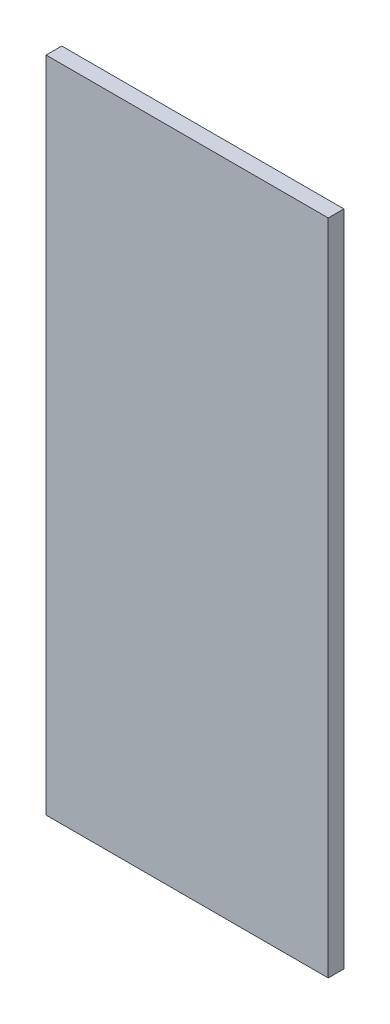
ISO-10303-21;
HEADER;
FILE_DESCRIPTION(('STEP AP214'),'2;1');
FILE_NAME('part.step','',(''),(''),'','','');
FILE_SCHEMA(('AUTOMOTIVE_DESIGN { 1 0 10303 214 1 1 1 1 }'));
ENDSEC;
DATA;
#1=APPLICATION_CONTEXT('core data for automotive mechanical design processes');
#2=APPLICATION_PROTOCOL_DEFINITION('international standard','automotive_design',2000,#1);
#3=PRODUCT_CONTEXT('',#1,'mechanical');
#4=PRODUCT('Part','Part','',(#3));
#5=PRODUCT_RELATED_PRODUCT_CATEGORY('part','',(#4));
#6=PRODUCT_DEFINITION_FORMATION('','',#4);
#7=PRODUCT_DEFINITION_CONTEXT('part definition',#1,'design');
#8=PRODUCT_DEFINITION('design','',#6,#7);
#9=PRODUCT_DEFINITION_SHAPE('','',#8);
#10=(LENGTH_UNIT() NAMED_UNIT(*) SI_UNIT(.MILLI.,.METRE.));
#11=(NAMED_UNIT(*) PLANE_ANGLE_UNIT() SI_UNIT($,.RADIAN.));
#12=(NAMED_UNIT(*) SI_UNIT($,.STERADIAN.) SOLID_ANGLE_UNIT());
#13=UNCERTAINTY_MEASURE_WITH_UNIT(LENGTH_MEASURE(1.E-05),#10,'distance_accuracy_value','');
#14=(GEOMETRIC_REPRESENTATION_CONTEXT(3) GLOBAL_UNCERTAINTY_ASSIGNED_CONTEXT((#13)) GLOBAL_UNIT_ASSIGNED_CONTEXT((#10,
#11,#12)) REPRESENTATION_CONTEXT('',''));
#15=CARTESIAN_POINT('',(0.,0.,0.));
#16=DIRECTION('',(0.,0.,1.));
#17=DIRECTION('',(1.,0.,0.));
#18=AXIS2_PLACEMENT_3D('',#15,#16,#17);
#19=CARTESIAN_POINT('',(224.613166788928,-127.373178207628,283.941063903925));
#20=DIRECTION('',(-1.,0.,0.));
#21=DIRECTION('',(0.,-1.,0.));
#22=AXIS2_PLACEMENT_3D('',#19,#20,#21);
#23=PLANE('',#22);
#24=DIRECTION('',(0.,1.,0.));
#25=VECTOR('',#24,1.);
#26=CARTESIAN_POINT('',(224.613166788928,-127.373178207628,283.432971220494));
#27=LINE('',#26,#25);
#28=CARTESIAN_POINT('',(224.613166788928,-127.373178207628,283.432971220494));
#29=VERTEX_POINT('',#28);
#30=CARTESIAN_POINT('',(224.613166788928,-106.020408950721,283.432971220494));
#31=VERTEX_POINT('',#30);
#32=EDGE_CURVE('E79',#29,#31,#27,.T.);
#33=ORIENTED_EDGE('',*,*,#32,.F.);
#34=DIRECTION('',(0.,0.,-1.));
#35=VECTOR('',#34,1.);
#36=CARTESIAN_POINT('',(224.613166788928,-127.373178207628,283.941063903925));
#37=LINE('',#36,#35);
#38=CARTESIAN_POINT('',(224.613166788928,-127.373178207628,283.941063903925));
#39=VERTEX_POINT('',#38);
#40=EDGE_CURVE('E32',#39,#29,#37,.T.);
#41=ORIENTED_EDGE('',*,*,#40,.F.);
#42=DIRECTION('',(0.,1.,0.));
#43=VECTOR('',#42,1.);
#44=CARTESIAN_POINT('',(224.613166788928,-127.373178207628,283.941063903925));
#45=LINE('',#44,#43);
#46=CARTESIAN_POINT('',(224.613166788928,-106.020408950721,283.941063903925));
#47=VERTEX_POINT('',#46);
#48=EDGE_CURVE('E71',#39,#47,#45,.T.);
#49=ORIENTED_EDGE('',*,*,#48,.T.);
#50=DIRECTION('',(0.,0.,-1.));
#51=VECTOR('',#50,1.);
#52=CARTESIAN_POINT('',(224.613166788928,-106.020408950721,283.941063903925));
#53=LINE('',#52,#51);
#54=EDGE_CURVE('E10',#47,#31,#53,.T.);
#55=ORIENTED_EDGE('',*,*,#54,.T.);
#56=EDGE_LOOP('',(#33,#41,#49,#55));
#57=FACE_BOUND('',#56,.T.);
#58=ADVANCED_FACE('F16',(#57),#23,.T.);
#59=CARTESIAN_POINT('',(224.613166788928,-106.020408950721,283.941063903925));
#60=DIRECTION('',(0.,1.,0.));
#61=DIRECTION('',(0.,0.,1.));
#62=AXIS2_PLACEMENT_3D('',#59,#60,#61);
#63=PLANE('',#62);
#64=DIRECTION('',(1.,0.,0.));
#65=VECTOR('',#64,1.);
#66=CARTESIAN_POINT('',(224.613166788928,-106.020408950721,283.432971220494));
#67=LINE('',#66,#65);
#68=CARTESIAN_POINT('',(233.765936045835,-106.020408950721,283.432971220494));
#69=VERTEX_POINT('',#68);
#70=EDGE_CURVE('E82',#31,#69,#67,.T.);
#71=ORIENTED_EDGE('',*,*,#70,.F.);
#72=ORIENTED_EDGE('',*,*,#54,.F.);
#73=DIRECTION('',(1.,0.,0.));
#74=VECTOR('',#73,1.);
#75=CARTESIAN_POINT('',(224.613166788928,-106.020408950721,283.941063903925));
#76=LINE('',#75,#74);
#77=CARTESIAN_POINT('',(233.765936045835,-106.020408950721,283.941063903925));
#78=VERTEX_POINT('',#77);
#79=EDGE_CURVE('E67',#47,#78,#76,.T.);
#80=ORIENTED_EDGE('',*,*,#79,.T.);
#81=DIRECTION('',(0.,0.,-1.));
#82=VECTOR('',#81,1.);
#83=CARTESIAN_POINT('',(233.765936045835,-106.020408950721,283.941063903925));
#84=LINE('',#83,#82);
#85=EDGE_CURVE('E24',#78,#69,#84,.T.);
#86=ORIENTED_EDGE('',*,*,#85,.T.);
#87=EDGE_LOOP('',(#71,#72,#80,#86));
#88=FACE_BOUND('',#87,.T.);
#89=ADVANCED_FACE('F68',(#88),#63,.T.);
#90=CARTESIAN_POINT('',(233.765936045835,-106.020408950721,283.941063903925));
#91=DIRECTION('',(1.,0.,0.));
#92=DIRECTION('',(0.,1.,0.));
#93=AXIS2_PLACEMENT_3D('',#90,#91,#92);
#94=PLANE('',#93);
#95=DIRECTION('',(0.,-1.,0.));
#96=VECTOR('',#95,1.);
#97=CARTESIAN_POINT('',(233.765936045835,-106.020408950721,283.432971220494));
#98=LINE('',#97,#96);
#99=CARTESIAN_POINT('',(233.765936045835,-127.373178207628,283.432971220494));
#100=VERTEX_POINT('',#99);
#101=EDGE_CURVE('E65',#69,#100,#98,.T.);
#102=ORIENTED_EDGE('',*,*,#101,.F.);
#103=ORIENTED_EDGE('',*,*,#85,.F.);
#104=DIRECTION('',(0.,-1.,0.));
#105=VECTOR('',#104,1.);
#106=CARTESIAN_POINT('',(233.765936045835,-106.020408950721,283.941063903925));
#107=LINE('',#106,#105);
#108=CARTESIAN_POINT('',(233.765936045835,-127.373178207628,283.941063903925));
#109=VERTEX_POINT('',#108);
#110=EDGE_CURVE('E62',#78,#109,#107,.T.);
#111=ORIENTED_EDGE('',*,*,#110,.T.);
#112=DIRECTION('',(0.,0.,-1.));
#113=VECTOR('',#112,1.);
#114=CARTESIAN_POINT('',(233.765936045835,-127.373178207628,283.941063903925));
#115=LINE('',#114,#113);
#116=EDGE_CURVE('E48',#109,#100,#115,.T.);
#117=ORIENTED_EDGE('',*,*,#116,.T.);
#118=EDGE_LOOP('',(#102,#103,#111,#117));
#119=FACE_BOUND('',#118,.T.);
#120=ADVANCED_FACE('F60',(#119),#94,.T.);
#121=CARTESIAN_POINT('',(233.765936045835,-127.373178207628,283.941063903925));
#122=DIRECTION('',(0.,-1.,0.));
#123=DIRECTION('',(0.,0.,-1.));
#124=AXIS2_PLACEMENT_3D('',#121,#122,#123);
#125=PLANE('',#124);
#126=DIRECTION('',(-1.,0.,0.));
#127=VECTOR('',#126,1.);
#128=CARTESIAN_POINT('',(233.765936045835,-127.373178207628,283.432971220494));
#129=LINE('',#128,#127);
#130=EDGE_CURVE('E85',#100,#29,#129,.T.);
#131=ORIENTED_EDGE('',*,*,#130,.F.);
#132=ORIENTED_EDGE('',*,*,#116,.F.);
#133=DIRECTION('',(-1.,0.,0.));
#134=VECTOR('',#133,1.);
#135=CARTESIAN_POINT('',(233.765936045835,-127.373178207628,283.941063903925));
#136=LINE('',#135,#134);
#137=EDGE_CURVE('E74',#109,#39,#136,.T.);
#138=ORIENTED_EDGE('',*,*,#137,.T.);
#139=ORIENTED_EDGE('',*,*,#40,.T.);
#140=EDGE_LOOP('',(#131,#132,#138,#139));
#141=FACE_BOUND('',#140,.T.);
#142=ADVANCED_FACE('F96',(#141),#125,.T.);
#143=CARTESIAN_POINT('',(206.339551417381,-113.096793579175,283.941063903925));
#144=DIRECTION('',(0.,0.,-1.));
#145=DIRECTION('',(0.,1.,0.));
#146=AXIS2_PLACEMENT_3D('',#143,#144,#145);
#147=PLANE('',#146);
#148=ORIENTED_EDGE('',*,*,#48,.F.);
#149=ORIENTED_EDGE('',*,*,#137,.F.);
#150=ORIENTED_EDGE('',*,*,#110,.F.);
#151=ORIENTED_EDGE('',*,*,#79,.F.);
#152=EDGE_LOOP('',(#148,#149,#150,#151));
#153=FACE_BOUND('',#152,.T.);
#154=ADVANCED_FACE('F73',(#153),#147,.F.);
#155=CARTESIAN_POINT('',(206.339551417381,-113.096793579175,283.432971220494));
#156=DIRECTION('',(0.,0.,-1.));
#157=DIRECTION('',(0.,1.,0.));
#158=AXIS2_PLACEMENT_3D('',#155,#156,#157);
#159=PLANE('',#158);
#160=ORIENTED_EDGE('',*,*,#32,.T.);
#161=ORIENTED_EDGE('',*,*,#70,.T.);
#162=ORIENTED_EDGE('',*,*,#101,.T.);
#163=ORIENTED_EDGE('',*,*,#130,.T.);
#164=EDGE_LOOP('',(#160,#161,#162,#163));
#165=FACE_BOUND('',#164,.T.);
#166=ADVANCED_FACE('F89',(#165),#159,.T.);
#167=CLOSED_SHELL('',(#58,#89,#120,#142,#154,#166));
#168=MANIFOLD_SOLID_BREP('B1',#167);
#169=ADVANCED_BREP_SHAPE_REPRESENTATION('',(#18,#168),#14);
#170=SHAPE_DEFINITION_REPRESENTATION(#9,#169);
ENDSEC;
END-ISO-10303-21;
